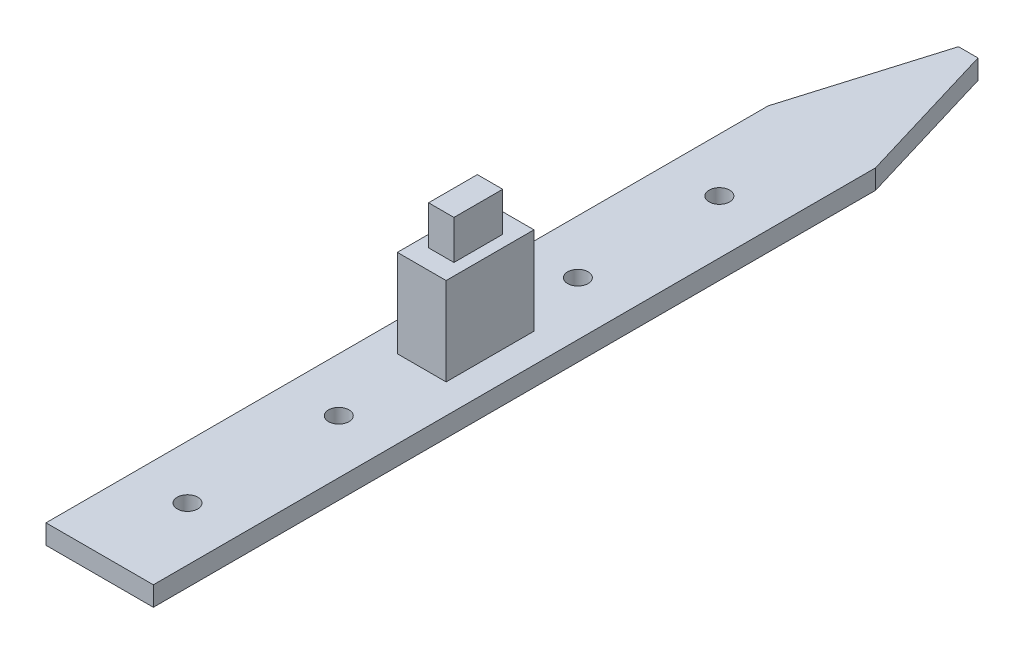
ISO-10303-21;
HEADER;
FILE_DESCRIPTION(('STEP AP214'),'2;1');
FILE_NAME('part.step','',(''),(''),'','','');
FILE_SCHEMA(('AUTOMOTIVE_DESIGN { 1 0 10303 214 1 1 1 1 }'));
ENDSEC;
DATA;
#1=APPLICATION_CONTEXT('core data for automotive mechanical design processes');
#2=APPLICATION_PROTOCOL_DEFINITION('international standard','automotive_design',2000,#1);
#3=PRODUCT_CONTEXT('',#1,'mechanical');
#4=PRODUCT('Part','Part','',(#3));
#5=PRODUCT_RELATED_PRODUCT_CATEGORY('part','',(#4));
#6=PRODUCT_DEFINITION_FORMATION('','',#4);
#7=PRODUCT_DEFINITION_CONTEXT('part definition',#1,'design');
#8=PRODUCT_DEFINITION('design','',#6,#7);
#9=PRODUCT_DEFINITION_SHAPE('','',#8);
#10=(LENGTH_UNIT() NAMED_UNIT(*) SI_UNIT(.MILLI.,.METRE.));
#11=(NAMED_UNIT(*) PLANE_ANGLE_UNIT() SI_UNIT($,.RADIAN.));
#12=(NAMED_UNIT(*) SI_UNIT($,.STERADIAN.) SOLID_ANGLE_UNIT());
#13=UNCERTAINTY_MEASURE_WITH_UNIT(LENGTH_MEASURE(1.E-05),#10,'distance_accuracy_value','');
#14=(GEOMETRIC_REPRESENTATION_CONTEXT(3) GLOBAL_UNCERTAINTY_ASSIGNED_CONTEXT((#13)) GLOBAL_UNIT_ASSIGNED_CONTEXT((#10,
#11,#12)) REPRESENTATION_CONTEXT('',''));
#15=CARTESIAN_POINT('',(0.,0.,0.));
#16=DIRECTION('',(0.,0.,1.));
#17=DIRECTION('',(1.,0.,0.));
#18=AXIS2_PLACEMENT_3D('',#15,#16,#17);
#19=CARTESIAN_POINT('',(0.,2.,0.));
#20=DIRECTION('',(0.,1.,0.));
#21=DIRECTION('',(0.,0.,1.));
#22=AXIS2_PLACEMENT_3D('',#19,#20,#21);
#23=PLANE('',#22);
#24=CARTESIAN_POINT('',(5.5,2.,-9.));
#25=DIRECTION('',(0.,1.,0.));
#26=DIRECTION('',(0.,0.,1.));
#27=AXIS2_PLACEMENT_3D('',#24,#25,#26);
#28=CIRCLE('',#27,1.05);
#29=CARTESIAN_POINT('',(5.5,2.,-7.95));
#30=VERTEX_POINT('',#29);
#31=EDGE_CURVE('E215',#30,#30,#28,.T.);
#32=ORIENTED_EDGE('',*,*,#31,.F.);
#33=EDGE_LOOP('',(#32));
#34=FACE_BOUND('',#33,.T.);
#35=CARTESIAN_POINT('',(5.5,2.,-24.5));
#36=DIRECTION('',(0.,1.,0.));
#37=DIRECTION('',(0.,0.,1.));
#38=AXIS2_PLACEMENT_3D('',#35,#36,#37);
#39=CIRCLE('',#38,1.05);
#40=CARTESIAN_POINT('',(5.5,2.,-23.45));
#41=VERTEX_POINT('',#40);
#42=EDGE_CURVE('E220',#41,#41,#39,.T.);
#43=ORIENTED_EDGE('',*,*,#42,.F.);
#44=EDGE_LOOP('',(#43));
#45=FACE_BOUND('',#44,.T.);
#46=CARTESIAN_POINT('',(5.5,2.,-49.));
#47=DIRECTION('',(0.,1.,0.));
#48=DIRECTION('',(0.,0.,1.));
#49=AXIS2_PLACEMENT_3D('',#46,#47,#48);
#50=CIRCLE('',#49,1.05);
#51=CARTESIAN_POINT('',(5.5,2.,-47.95));
#52=VERTEX_POINT('',#51);
#53=EDGE_CURVE('E229',#52,#52,#50,.T.);
#54=ORIENTED_EDGE('',*,*,#53,.F.);
#55=EDGE_LOOP('',(#54));
#56=FACE_BOUND('',#55,.T.);
#57=CARTESIAN_POINT('',(5.5,2.,-63.5));
#58=DIRECTION('',(0.,1.,0.));
#59=DIRECTION('',(0.,0.,1.));
#60=AXIS2_PLACEMENT_3D('',#57,#58,#59);
#61=CIRCLE('',#60,1.04999999999999);
#62=CARTESIAN_POINT('',(5.5,2.,-62.45));
#63=VERTEX_POINT('',#62);
#64=EDGE_CURVE('E237',#63,#63,#61,.T.);
#65=ORIENTED_EDGE('',*,*,#64,.F.);
#66=EDGE_LOOP('',(#65));
#67=FACE_BOUND('',#66,.T.);
#68=DIRECTION('',(0.,0.,1.));
#69=VECTOR('',#68,1.);
#70=CARTESIAN_POINT('',(0.,2.,-74.));
#71=LINE('',#70,#69);
#72=CARTESIAN_POINT('',(0.,2.,-74.));
#73=VERTEX_POINT('',#72);
#74=CARTESIAN_POINT('',(0.,2.,0.));
#75=VERTEX_POINT('',#74);
#76=EDGE_CURVE('E273',#73,#75,#71,.T.);
#77=ORIENTED_EDGE('',*,*,#76,.T.);
#78=DIRECTION('',(1.,0.,0.));
#79=VECTOR('',#78,1.);
#80=CARTESIAN_POINT('',(0.,2.,0.));
#81=LINE('',#80,#79);
#82=CARTESIAN_POINT('',(11.,2.,0.));
#83=VERTEX_POINT('',#82);
#84=EDGE_CURVE('E277',#75,#83,#81,.T.);
#85=ORIENTED_EDGE('',*,*,#84,.T.);
#86=DIRECTION('',(0.,0.,1.));
#87=VECTOR('',#86,1.);
#88=CARTESIAN_POINT('',(11.,2.,-74.));
#89=LINE('',#88,#87);
#90=CARTESIAN_POINT('',(11.,2.,-74.));
#91=VERTEX_POINT('',#90);
#92=EDGE_CURVE('E247',#91,#83,#89,.T.);
#93=ORIENTED_EDGE('',*,*,#92,.F.);
#94=DIRECTION('',(0.287347885566346,0.,0.957826285221151));
#95=VECTOR('',#94,1.);
#96=CARTESIAN_POINT('',(6.5,2.,-89.));
#97=LINE('',#96,#95);
#98=CARTESIAN_POINT('',(6.5,2.,-89.));
#99=VERTEX_POINT('',#98);
#100=EDGE_CURVE('E251',#99,#91,#97,.T.);
#101=ORIENTED_EDGE('',*,*,#100,.F.);
#102=DIRECTION('',(-1.,0.,0.));
#103=VECTOR('',#102,1.);
#104=CARTESIAN_POINT('',(5.5,2.,-89.));
#105=LINE('',#104,#103);
#106=CARTESIAN_POINT('',(4.5,2.,-89.));
#107=VERTEX_POINT('',#106);
#108=EDGE_CURVE('E281',#99,#107,#105,.T.);
#109=ORIENTED_EDGE('',*,*,#108,.T.);
#110=DIRECTION('',(-0.287347885566346,0.,0.957826285221151));
#111=VECTOR('',#110,1.);
#112=CARTESIAN_POINT('',(4.5,2.,-89.));
#113=LINE('',#112,#111);
#114=EDGE_CURVE('E284',#107,#73,#113,.T.);
#115=ORIENTED_EDGE('',*,*,#114,.T.);
#116=EDGE_LOOP('',(#77,#85,#93,#101,#109,#115));
#117=FACE_BOUND('',#116,.T.);
#118=DIRECTION('',(0.,0.,1.));
#119=VECTOR('',#118,1.);
#120=CARTESIAN_POINT('',(3.,2.,-42.));
#121=LINE('',#120,#119);
#122=CARTESIAN_POINT('',(3.,2.,-42.));
#123=VERTEX_POINT('',#122);
#124=CARTESIAN_POINT('',(3.,2.,-33.));
#125=VERTEX_POINT('',#124);
#126=EDGE_CURVE('E172',#123,#125,#121,.T.);
#127=ORIENTED_EDGE('',*,*,#126,.F.);
#128=DIRECTION('',(-1.,0.,0.));
#129=VECTOR('',#128,1.);
#130=CARTESIAN_POINT('',(8.,2.,-42.));
#131=LINE('',#130,#129);
#132=CARTESIAN_POINT('',(8.,2.,-42.));
#133=VERTEX_POINT('',#132);
#134=EDGE_CURVE('E167',#133,#123,#131,.T.);
#135=ORIENTED_EDGE('',*,*,#134,.F.);
#136=DIRECTION('',(0.,0.,-1.));
#137=VECTOR('',#136,1.);
#138=CARTESIAN_POINT('',(8.,2.,-33.));
#139=LINE('',#138,#137);
#140=CARTESIAN_POINT('',(8.,2.,-33.));
#141=VERTEX_POINT('',#140);
#142=EDGE_CURVE('E183',#141,#133,#139,.T.);
#143=ORIENTED_EDGE('',*,*,#142,.F.);
#144=DIRECTION('',(1.,0.,0.));
#145=VECTOR('',#144,1.);
#146=CARTESIAN_POINT('',(3.,2.,-33.));
#147=LINE('',#146,#145);
#148=EDGE_CURVE('E195',#125,#141,#147,.T.);
#149=ORIENTED_EDGE('',*,*,#148,.F.);
#150=EDGE_LOOP('',(#127,#135,#143,#149));
#151=FACE_BOUND('',#150,.T.);
#152=ADVANCED_FACE('F42',(#34,#45,#56,#67,#117,#151),#23,.T.);
#153=CARTESIAN_POINT('',(0.,2.,-74.));
#154=DIRECTION('',(1.,0.,0.));
#155=DIRECTION('',(0.,0.,-1.));
#156=AXIS2_PLACEMENT_3D('',#153,#154,#155);
#157=PLANE('',#156);
#158=DIRECTION('',(0.,0.,1.));
#159=VECTOR('',#158,1.);
#160=CARTESIAN_POINT('',(0.,0.,-74.));
#161=LINE('',#160,#159);
#162=CARTESIAN_POINT('',(0.,0.,-74.));
#163=VERTEX_POINT('',#162);
#164=CARTESIAN_POINT('',(0.,0.,0.));
#165=VERTEX_POINT('',#164);
#166=EDGE_CURVE('E272',#163,#165,#161,.T.);
#167=ORIENTED_EDGE('',*,*,#166,.T.);
#168=DIRECTION('',(0.,-1.,0.));
#169=VECTOR('',#168,1.);
#170=CARTESIAN_POINT('',(0.,2.,0.));
#171=LINE('',#170,#169);
#172=EDGE_CURVE('E11',#75,#165,#171,.T.);
#173=ORIENTED_EDGE('',*,*,#172,.F.);
#174=ORIENTED_EDGE('',*,*,#76,.F.);
#175=DIRECTION('',(0.,-1.,0.));
#176=VECTOR('',#175,1.);
#177=CARTESIAN_POINT('',(0.,2.,-74.));
#178=LINE('',#177,#176);
#179=EDGE_CURVE('E287',#73,#163,#178,.T.);
#180=ORIENTED_EDGE('',*,*,#179,.T.);
#181=EDGE_LOOP('',(#167,#173,#174,#180));
#182=FACE_BOUND('',#181,.T.);
#183=ADVANCED_FACE('F44',(#182),#157,.F.);
#184=CARTESIAN_POINT('',(0.,2.,0.));
#185=DIRECTION('',(0.,0.,-1.));
#186=DIRECTION('',(-1.,0.,0.));
#187=AXIS2_PLACEMENT_3D('',#184,#185,#186);
#188=PLANE('',#187);
#189=DIRECTION('',(1.,0.,0.));
#190=VECTOR('',#189,1.);
#191=CARTESIAN_POINT('',(0.,0.,0.));
#192=LINE('',#191,#190);
#193=CARTESIAN_POINT('',(11.,0.,0.));
#194=VERTEX_POINT('',#193);
#195=EDGE_CURVE('E291',#165,#194,#192,.T.);
#196=ORIENTED_EDGE('',*,*,#195,.T.);
#197=DIRECTION('',(0.,-1.,0.));
#198=VECTOR('',#197,1.);
#199=CARTESIAN_POINT('',(11.,2.,0.));
#200=LINE('',#199,#198);
#201=EDGE_CURVE('E268',#83,#194,#200,.T.);
#202=ORIENTED_EDGE('',*,*,#201,.F.);
#203=ORIENTED_EDGE('',*,*,#84,.F.);
#204=ORIENTED_EDGE('',*,*,#172,.T.);
#205=EDGE_LOOP('',(#196,#202,#203,#204));
#206=FACE_BOUND('',#205,.T.);
#207=ADVANCED_FACE('F331',(#206),#188,.F.);
#208=CARTESIAN_POINT('',(5.5,2.,-89.));
#209=DIRECTION('',(0.,0.,1.));
#210=DIRECTION('',(1.,0.,0.));
#211=AXIS2_PLACEMENT_3D('',#208,#209,#210);
#212=PLANE('',#211);
#213=DIRECTION('',(-1.,0.,0.));
#214=VECTOR('',#213,1.);
#215=CARTESIAN_POINT('',(5.5,0.,-89.));
#216=LINE('',#215,#214);
#217=CARTESIAN_POINT('',(6.5,0.,-89.));
#218=VERTEX_POINT('',#217);
#219=CARTESIAN_POINT('',(4.5,0.,-89.));
#220=VERTEX_POINT('',#219);
#221=EDGE_CURVE('E294',#218,#220,#216,.T.);
#222=ORIENTED_EDGE('',*,*,#221,.T.);
#223=DIRECTION('',(0.,-1.,0.));
#224=VECTOR('',#223,1.);
#225=CARTESIAN_POINT('',(4.5,2.,-89.));
#226=LINE('',#225,#224);
#227=EDGE_CURVE('E51',#107,#220,#226,.T.);
#228=ORIENTED_EDGE('',*,*,#227,.F.);
#229=ORIENTED_EDGE('',*,*,#108,.F.);
#230=DIRECTION('',(0.,-1.,0.));
#231=VECTOR('',#230,1.);
#232=CARTESIAN_POINT('',(6.5,2.,-89.));
#233=LINE('',#232,#231);
#234=EDGE_CURVE('E264',#99,#218,#233,.T.);
#235=ORIENTED_EDGE('',*,*,#234,.T.);
#236=EDGE_LOOP('',(#222,#228,#229,#235));
#237=FACE_BOUND('',#236,.T.);
#238=ADVANCED_FACE('F323',(#237),#212,.F.);
#239=CARTESIAN_POINT('',(4.5,2.,-89.));
#240=DIRECTION('',(0.957826285221151,0.,0.287347885566346));
#241=DIRECTION('',(0.287347885566346,0.,-0.957826285221151));
#242=AXIS2_PLACEMENT_3D('',#239,#240,#241);
#243=PLANE('',#242);
#244=DIRECTION('',(-0.287347885566346,0.,0.957826285221151));
#245=VECTOR('',#244,1.);
#246=CARTESIAN_POINT('',(4.5,0.,-89.));
#247=LINE('',#246,#245);
#248=EDGE_CURVE('E278',#220,#163,#247,.T.);
#249=ORIENTED_EDGE('',*,*,#248,.T.);
#250=ORIENTED_EDGE('',*,*,#179,.F.);
#251=ORIENTED_EDGE('',*,*,#114,.F.);
#252=ORIENTED_EDGE('',*,*,#227,.T.);
#253=EDGE_LOOP('',(#249,#250,#251,#252));
#254=FACE_BOUND('',#253,.T.);
#255=ADVANCED_FACE('F307',(#254),#243,.F.);
#256=CARTESIAN_POINT('',(0.,0.,0.));
#257=DIRECTION('',(0.,1.,0.));
#258=DIRECTION('',(0.,0.,1.));
#259=AXIS2_PLACEMENT_3D('',#256,#257,#258);
#260=PLANE('',#259);
#261=CARTESIAN_POINT('',(5.5,0.,-9.));
#262=DIRECTION('',(0.,1.,0.));
#263=DIRECTION('',(0.,0.,1.));
#264=AXIS2_PLACEMENT_3D('',#261,#262,#263);
#265=CIRCLE('',#264,1.05);
#266=CARTESIAN_POINT('',(5.5,0.,-7.95));
#267=VERTEX_POINT('',#266);
#268=EDGE_CURVE('E219',#267,#267,#265,.F.);
#269=ORIENTED_EDGE('',*,*,#268,.F.);
#270=EDGE_LOOP('',(#269));
#271=FACE_BOUND('',#270,.T.);
#272=CARTESIAN_POINT('',(5.5,0.,-24.5));
#273=DIRECTION('',(0.,1.,0.));
#274=DIRECTION('',(0.,0.,1.));
#275=AXIS2_PLACEMENT_3D('',#272,#273,#274);
#276=CIRCLE('',#275,1.05);
#277=CARTESIAN_POINT('',(5.5,0.,-23.45));
#278=VERTEX_POINT('',#277);
#279=EDGE_CURVE('E225',#278,#278,#276,.F.);
#280=ORIENTED_EDGE('',*,*,#279,.F.);
#281=EDGE_LOOP('',(#280));
#282=FACE_BOUND('',#281,.T.);
#283=CARTESIAN_POINT('',(5.5,0.,-49.));
#284=DIRECTION('',(0.,1.,0.));
#285=DIRECTION('',(0.,0.,1.));
#286=AXIS2_PLACEMENT_3D('',#283,#284,#285);
#287=CIRCLE('',#286,1.05);
#288=CARTESIAN_POINT('',(5.5,0.,-47.95));
#289=VERTEX_POINT('',#288);
#290=EDGE_CURVE('E233',#289,#289,#287,.F.);
#291=ORIENTED_EDGE('',*,*,#290,.F.);
#292=EDGE_LOOP('',(#291));
#293=FACE_BOUND('',#292,.T.);
#294=CARTESIAN_POINT('',(5.5,0.,-63.5));
#295=DIRECTION('',(0.,1.,0.));
#296=DIRECTION('',(0.,0.,1.));
#297=AXIS2_PLACEMENT_3D('',#294,#295,#296);
#298=CIRCLE('',#297,1.04999999999999);
#299=CARTESIAN_POINT('',(5.5,0.,-62.45));
#300=VERTEX_POINT('',#299);
#301=EDGE_CURVE('E214',#300,#300,#298,.F.);
#302=ORIENTED_EDGE('',*,*,#301,.F.);
#303=EDGE_LOOP('',(#302));
#304=FACE_BOUND('',#303,.T.);
#305=ORIENTED_EDGE('',*,*,#166,.F.);
#306=ORIENTED_EDGE('',*,*,#248,.F.);
#307=ORIENTED_EDGE('',*,*,#221,.F.);
#308=DIRECTION('',(0.287347885566346,0.,0.957826285221151));
#309=VECTOR('',#308,1.);
#310=CARTESIAN_POINT('',(6.5,0.,-89.));
#311=LINE('',#310,#309);
#312=CARTESIAN_POINT('',(11.,0.,-74.));
#313=VERTEX_POINT('',#312);
#314=EDGE_CURVE('E252',#218,#313,#311,.T.);
#315=ORIENTED_EDGE('',*,*,#314,.T.);
#316=DIRECTION('',(0.,0.,1.));
#317=VECTOR('',#316,1.);
#318=CARTESIAN_POINT('',(11.,0.,-74.));
#319=LINE('',#318,#317);
#320=EDGE_CURVE('E224',#313,#194,#319,.T.);
#321=ORIENTED_EDGE('',*,*,#320,.T.);
#322=ORIENTED_EDGE('',*,*,#195,.F.);
#323=EDGE_LOOP('',(#305,#306,#307,#315,#321,#322));
#324=FACE_BOUND('',#323,.T.);
#325=ADVANCED_FACE('F312',(#271,#282,#293,#304,#324),#260,.F.);
#326=CARTESIAN_POINT('',(11.,2.,-74.));
#327=DIRECTION('',(-1.,0.,0.));
#328=DIRECTION('',(0.,0.,-1.));
#329=AXIS2_PLACEMENT_3D('',#326,#327,#328);
#330=PLANE('',#329);
#331=ORIENTED_EDGE('',*,*,#320,.F.);
#332=DIRECTION('',(0.,-1.,0.));
#333=VECTOR('',#332,1.);
#334=CARTESIAN_POINT('',(11.,2.,-74.));
#335=LINE('',#334,#333);
#336=EDGE_CURVE('E255',#91,#313,#335,.T.);
#337=ORIENTED_EDGE('',*,*,#336,.F.);
#338=ORIENTED_EDGE('',*,*,#92,.T.);
#339=ORIENTED_EDGE('',*,*,#201,.T.);
#340=EDGE_LOOP('',(#331,#337,#338,#339));
#341=FACE_BOUND('',#340,.T.);
#342=ADVANCED_FACE('F329',(#341),#330,.F.);
#343=CARTESIAN_POINT('',(6.5,2.,-89.));
#344=DIRECTION('',(-0.957826285221151,0.,0.287347885566346));
#345=DIRECTION('',(-0.287347885566346,0.,-0.957826285221151));
#346=AXIS2_PLACEMENT_3D('',#343,#344,#345);
#347=PLANE('',#346);
#348=ORIENTED_EDGE('',*,*,#314,.F.);
#349=ORIENTED_EDGE('',*,*,#234,.F.);
#350=ORIENTED_EDGE('',*,*,#100,.T.);
#351=ORIENTED_EDGE('',*,*,#336,.T.);
#352=EDGE_LOOP('',(#348,#349,#350,#351));
#353=FACE_BOUND('',#352,.T.);
#354=ADVANCED_FACE('F325',(#353),#347,.F.);
#355=CARTESIAN_POINT('',(5.5,-2.96984848098351,-63.5));
#356=DIRECTION('',(0.,1.,0.));
#357=DIRECTION('',(0.,0.,1.));
#358=AXIS2_PLACEMENT_3D('',#355,#356,#357);
#359=CYLINDRICAL_SURFACE('',#358,1.04999999999999);
#360=ORIENTED_EDGE('',*,*,#301,.T.);
#361=EDGE_LOOP('',(#360));
#362=FACE_BOUND('',#361,.T.);
#363=ORIENTED_EDGE('',*,*,#64,.T.);
#364=EDGE_LOOP('',(#363));
#365=FACE_BOUND('',#364,.T.);
#366=ADVANCED_FACE('F373',(#362,#365),#359,.F.);
#367=CARTESIAN_POINT('',(5.5,-2.96984848098351,-49.));
#368=DIRECTION('',(0.,1.,0.));
#369=DIRECTION('',(0.,0.,1.));
#370=AXIS2_PLACEMENT_3D('',#367,#368,#369);
#371=CYLINDRICAL_SURFACE('',#370,1.05);
#372=ORIENTED_EDGE('',*,*,#290,.T.);
#373=EDGE_LOOP('',(#372));
#374=FACE_BOUND('',#373,.T.);
#375=ORIENTED_EDGE('',*,*,#53,.T.);
#376=EDGE_LOOP('',(#375));
#377=FACE_BOUND('',#376,.T.);
#378=ADVANCED_FACE('F378',(#374,#377),#371,.F.);
#379=CARTESIAN_POINT('',(5.5,-2.96984848098351,-24.5));
#380=DIRECTION('',(0.,1.,0.));
#381=DIRECTION('',(0.,0.,1.));
#382=AXIS2_PLACEMENT_3D('',#379,#380,#381);
#383=CYLINDRICAL_SURFACE('',#382,1.05);
#384=ORIENTED_EDGE('',*,*,#279,.T.);
#385=EDGE_LOOP('',(#384));
#386=FACE_BOUND('',#385,.T.);
#387=ORIENTED_EDGE('',*,*,#42,.T.);
#388=EDGE_LOOP('',(#387));
#389=FACE_BOUND('',#388,.T.);
#390=ADVANCED_FACE('F386',(#386,#389),#383,.F.);
#391=CARTESIAN_POINT('',(5.5,-2.96984848098351,-9.));
#392=DIRECTION('',(0.,1.,0.));
#393=DIRECTION('',(0.,0.,1.));
#394=AXIS2_PLACEMENT_3D('',#391,#392,#393);
#395=CYLINDRICAL_SURFACE('',#394,1.05);
#396=ORIENTED_EDGE('',*,*,#268,.T.);
#397=EDGE_LOOP('',(#396));
#398=FACE_BOUND('',#397,.T.);
#399=ORIENTED_EDGE('',*,*,#31,.T.);
#400=EDGE_LOOP('',(#399));
#401=FACE_BOUND('',#400,.T.);
#402=ADVANCED_FACE('F394',(#398,#401),#395,.F.);
#403=CARTESIAN_POINT('',(8.,11.,-42.));
#404=DIRECTION('',(0.,0.,1.));
#405=DIRECTION('',(1.,0.,0.));
#406=AXIS2_PLACEMENT_3D('',#403,#404,#405);
#407=PLANE('',#406);
#408=ORIENTED_EDGE('',*,*,#134,.T.);
#409=DIRECTION('',(0.,-1.,0.));
#410=VECTOR('',#409,1.);
#411=CARTESIAN_POINT('',(3.,11.,-42.));
#412=LINE('',#411,#410);
#413=CARTESIAN_POINT('',(3.,11.,-42.));
#414=VERTEX_POINT('',#413);
#415=EDGE_CURVE('E211',#414,#123,#412,.T.);
#416=ORIENTED_EDGE('',*,*,#415,.F.);
#417=DIRECTION('',(-1.,0.,0.));
#418=VECTOR('',#417,1.);
#419=CARTESIAN_POINT('',(8.,11.,-42.));
#420=LINE('',#419,#418);
#421=CARTESIAN_POINT('',(8.,11.,-42.));
#422=VERTEX_POINT('',#421);
#423=EDGE_CURVE('E178',#422,#414,#420,.T.);
#424=ORIENTED_EDGE('',*,*,#423,.F.);
#425=DIRECTION('',(0.,-1.,0.));
#426=VECTOR('',#425,1.);
#427=CARTESIAN_POINT('',(8.,11.,-42.));
#428=LINE('',#427,#426);
#429=EDGE_CURVE('E191',#422,#133,#428,.T.);
#430=ORIENTED_EDGE('',*,*,#429,.T.);
#431=EDGE_LOOP('',(#408,#416,#424,#430));
#432=FACE_BOUND('',#431,.T.);
#433=ADVANCED_FACE('F402',(#432),#407,.F.);
#434=CARTESIAN_POINT('',(3.,11.,-42.));
#435=DIRECTION('',(1.,0.,0.));
#436=DIRECTION('',(0.,0.,-1.));
#437=AXIS2_PLACEMENT_3D('',#434,#435,#436);
#438=PLANE('',#437);
#439=ORIENTED_EDGE('',*,*,#126,.T.);
#440=DIRECTION('',(0.,-1.,0.));
#441=VECTOR('',#440,1.);
#442=CARTESIAN_POINT('',(3.,11.,-33.));
#443=LINE('',#442,#441);
#444=CARTESIAN_POINT('',(3.,11.,-33.));
#445=VERTEX_POINT('',#444);
#446=EDGE_CURVE('E207',#445,#125,#443,.T.);
#447=ORIENTED_EDGE('',*,*,#446,.F.);
#448=DIRECTION('',(0.,0.,1.));
#449=VECTOR('',#448,1.);
#450=CARTESIAN_POINT('',(3.,11.,-42.));
#451=LINE('',#450,#449);
#452=EDGE_CURVE('E182',#414,#445,#451,.T.);
#453=ORIENTED_EDGE('',*,*,#452,.F.);
#454=ORIENTED_EDGE('',*,*,#415,.T.);
#455=EDGE_LOOP('',(#439,#447,#453,#454));
#456=FACE_BOUND('',#455,.T.);
#457=ADVANCED_FACE('F410',(#456),#438,.F.);
#458=CARTESIAN_POINT('',(3.,11.,-33.));
#459=DIRECTION('',(0.,0.,-1.));
#460=DIRECTION('',(-1.,0.,0.));
#461=AXIS2_PLACEMENT_3D('',#458,#459,#460);
#462=PLANE('',#461);
#463=ORIENTED_EDGE('',*,*,#148,.T.);
#464=DIRECTION('',(0.,-1.,0.));
#465=VECTOR('',#464,1.);
#466=CARTESIAN_POINT('',(8.,11.,-33.));
#467=LINE('',#466,#465);
#468=CARTESIAN_POINT('',(8.,11.,-33.));
#469=VERTEX_POINT('',#468);
#470=EDGE_CURVE('E204',#469,#141,#467,.T.);
#471=ORIENTED_EDGE('',*,*,#470,.F.);
#472=DIRECTION('',(1.,0.,0.));
#473=VECTOR('',#472,1.);
#474=CARTESIAN_POINT('',(3.,11.,-33.));
#475=LINE('',#474,#473);
#476=EDGE_CURVE('E186',#445,#469,#475,.T.);
#477=ORIENTED_EDGE('',*,*,#476,.F.);
#478=ORIENTED_EDGE('',*,*,#446,.T.);
#479=EDGE_LOOP('',(#463,#471,#477,#478));
#480=FACE_BOUND('',#479,.T.);
#481=ADVANCED_FACE('F418',(#480),#462,.F.);
#482=CARTESIAN_POINT('',(8.,11.,-33.));
#483=DIRECTION('',(-1.,0.,0.));
#484=DIRECTION('',(0.,0.,1.));
#485=AXIS2_PLACEMENT_3D('',#482,#483,#484);
#486=PLANE('',#485);
#487=ORIENTED_EDGE('',*,*,#142,.T.);
#488=ORIENTED_EDGE('',*,*,#429,.F.);
#489=DIRECTION('',(0.,0.,-1.));
#490=VECTOR('',#489,1.);
#491=CARTESIAN_POINT('',(8.,11.,-33.));
#492=LINE('',#491,#490);
#493=EDGE_CURVE('E189',#469,#422,#492,.T.);
#494=ORIENTED_EDGE('',*,*,#493,.F.);
#495=ORIENTED_EDGE('',*,*,#470,.T.);
#496=EDGE_LOOP('',(#487,#488,#494,#495));
#497=FACE_BOUND('',#496,.T.);
#498=ADVANCED_FACE('F426',(#497),#486,.F.);
#499=CARTESIAN_POINT('',(0.,11.,0.));
#500=DIRECTION('',(0.,1.,0.));
#501=DIRECTION('',(0.,0.,1.));
#502=AXIS2_PLACEMENT_3D('',#499,#500,#501);
#503=PLANE('',#502);
#504=DIRECTION('',(0.,0.,1.));
#505=VECTOR('',#504,1.);
#506=CARTESIAN_POINT('',(4.2,11.,-40.));
#507=LINE('',#506,#505);
#508=CARTESIAN_POINT('',(4.2,11.,-40.));
#509=VERTEX_POINT('',#508);
#510=CARTESIAN_POINT('',(4.2,11.,-35.));
#511=VERTEX_POINT('',#510);
#512=EDGE_CURVE('E58',#509,#511,#507,.T.);
#513=ORIENTED_EDGE('',*,*,#512,.F.);
#514=DIRECTION('',(-1.,0.,0.));
#515=VECTOR('',#514,1.);
#516=CARTESIAN_POINT('',(4.2,11.,-40.));
#517=LINE('',#516,#515);
#518=CARTESIAN_POINT('',(6.8,11.,-40.));
#519=VERTEX_POINT('',#518);
#520=EDGE_CURVE('E62',#519,#509,#517,.T.);
#521=ORIENTED_EDGE('',*,*,#520,.F.);
#522=DIRECTION('',(0.,0.,-1.));
#523=VECTOR('',#522,1.);
#524=CARTESIAN_POINT('',(6.8,11.,-40.));
#525=LINE('',#524,#523);
#526=CARTESIAN_POINT('',(6.8,11.,-35.));
#527=VERTEX_POINT('',#526);
#528=EDGE_CURVE('E591',#527,#519,#525,.T.);
#529=ORIENTED_EDGE('',*,*,#528,.F.);
#530=DIRECTION('',(1.,0.,0.));
#531=VECTOR('',#530,1.);
#532=CARTESIAN_POINT('',(4.2,11.,-35.));
#533=LINE('',#532,#531);
#534=EDGE_CURVE('E601',#511,#527,#533,.T.);
#535=ORIENTED_EDGE('',*,*,#534,.F.);
#536=EDGE_LOOP('',(#513,#521,#529,#535));
#537=FACE_BOUND('',#536,.T.);
#538=ORIENTED_EDGE('',*,*,#423,.T.);
#539=ORIENTED_EDGE('',*,*,#452,.T.);
#540=ORIENTED_EDGE('',*,*,#476,.T.);
#541=ORIENTED_EDGE('',*,*,#493,.T.);
#542=EDGE_LOOP('',(#538,#539,#540,#541));
#543=FACE_BOUND('',#542,.T.);
#544=ADVANCED_FACE('F434',(#537,#543),#503,.T.);
#545=CARTESIAN_POINT('',(4.2,15.,-40.));
#546=DIRECTION('',(1.,0.,0.));
#547=DIRECTION('',(0.,0.,-1.));
#548=AXIS2_PLACEMENT_3D('',#545,#546,#547);
#549=PLANE('',#548);
#550=ORIENTED_EDGE('',*,*,#512,.T.);
#551=DIRECTION('',(0.,-1.,0.));
#552=VECTOR('',#551,1.);
#553=CARTESIAN_POINT('',(4.2,15.,-35.));
#554=LINE('',#553,#552);
#555=CARTESIAN_POINT('',(4.2,15.,-35.));
#556=VERTEX_POINT('',#555);
#557=EDGE_CURVE('E147',#556,#511,#554,.T.);
#558=ORIENTED_EDGE('',*,*,#557,.F.);
#559=DIRECTION('',(0.,0.,1.));
#560=VECTOR('',#559,1.);
#561=CARTESIAN_POINT('',(4.2,15.,-40.));
#562=LINE('',#561,#560);
#563=CARTESIAN_POINT('',(4.2,15.,-40.));
#564=VERTEX_POINT('',#563);
#565=EDGE_CURVE('E154',#564,#556,#562,.T.);
#566=ORIENTED_EDGE('',*,*,#565,.F.);
#567=DIRECTION('',(0.,-1.,0.));
#568=VECTOR('',#567,1.);
#569=CARTESIAN_POINT('',(4.2,15.,-40.));
#570=LINE('',#569,#568);
#571=EDGE_CURVE('E588',#564,#509,#570,.T.);
#572=ORIENTED_EDGE('',*,*,#571,.T.);
#573=EDGE_LOOP('',(#550,#558,#566,#572));
#574=FACE_BOUND('',#573,.T.);
#575=ADVANCED_FACE('F165',(#574),#549,.F.);
#576=CARTESIAN_POINT('',(4.2,15.,-35.));
#577=DIRECTION('',(0.,0.,-1.));
#578=DIRECTION('',(-1.,0.,0.));
#579=AXIS2_PLACEMENT_3D('',#576,#577,#578);
#580=PLANE('',#579);
#581=ORIENTED_EDGE('',*,*,#534,.T.);
#582=DIRECTION('',(0.,-1.,0.));
#583=VECTOR('',#582,1.);
#584=CARTESIAN_POINT('',(6.8,15.,-35.));
#585=LINE('',#584,#583);
#586=CARTESIAN_POINT('',(6.8,15.,-35.));
#587=VERTEX_POINT('',#586);
#588=EDGE_CURVE('E149',#587,#527,#585,.T.);
#589=ORIENTED_EDGE('',*,*,#588,.F.);
#590=DIRECTION('',(1.,0.,0.));
#591=VECTOR('',#590,1.);
#592=CARTESIAN_POINT('',(4.2,15.,-35.));
#593=LINE('',#592,#591);
#594=EDGE_CURVE('E142',#556,#587,#593,.T.);
#595=ORIENTED_EDGE('',*,*,#594,.F.);
#596=ORIENTED_EDGE('',*,*,#557,.T.);
#597=EDGE_LOOP('',(#581,#589,#595,#596));
#598=FACE_BOUND('',#597,.T.);
#599=ADVANCED_FACE('F145',(#598),#580,.F.);
#600=CARTESIAN_POINT('',(6.8,15.,-40.));
#601=DIRECTION('',(-1.,0.,0.));
#602=DIRECTION('',(0.,0.,1.));
#603=AXIS2_PLACEMENT_3D('',#600,#601,#602);
#604=PLANE('',#603);
#605=ORIENTED_EDGE('',*,*,#528,.T.);
#606=DIRECTION('',(0.,-1.,0.));
#607=VECTOR('',#606,1.);
#608=CARTESIAN_POINT('',(6.8,15.,-40.));
#609=LINE('',#608,#607);
#610=CARTESIAN_POINT('',(6.8,15.,-40.));
#611=VERTEX_POINT('',#610);
#612=EDGE_CURVE('E174',#611,#519,#609,.T.);
#613=ORIENTED_EDGE('',*,*,#612,.F.);
#614=DIRECTION('',(0.,0.,-1.));
#615=VECTOR('',#614,1.);
#616=CARTESIAN_POINT('',(6.8,15.,-40.));
#617=LINE('',#616,#615);
#618=EDGE_CURVE('E153',#587,#611,#617,.T.);
#619=ORIENTED_EDGE('',*,*,#618,.F.);
#620=ORIENTED_EDGE('',*,*,#588,.T.);
#621=EDGE_LOOP('',(#605,#613,#619,#620));
#622=FACE_BOUND('',#621,.T.);
#623=ADVANCED_FACE('F454',(#622),#604,.F.);
#624=CARTESIAN_POINT('',(4.2,15.,-40.));
#625=DIRECTION('',(0.,0.,1.));
#626=DIRECTION('',(1.,0.,0.));
#627=AXIS2_PLACEMENT_3D('',#624,#625,#626);
#628=PLANE('',#627);
#629=ORIENTED_EDGE('',*,*,#520,.T.);
#630=ORIENTED_EDGE('',*,*,#571,.F.);
#631=DIRECTION('',(-1.,0.,0.));
#632=VECTOR('',#631,1.);
#633=CARTESIAN_POINT('',(4.2,15.,-40.));
#634=LINE('',#633,#632);
#635=EDGE_CURVE('E159',#611,#564,#634,.T.);
#636=ORIENTED_EDGE('',*,*,#635,.F.);
#637=ORIENTED_EDGE('',*,*,#612,.T.);
#638=EDGE_LOOP('',(#629,#630,#636,#637));
#639=FACE_BOUND('',#638,.T.);
#640=ADVANCED_FACE('F461',(#639),#628,.F.);
#641=CARTESIAN_POINT('',(0.,15.,0.));
#642=DIRECTION('',(0.,1.,0.));
#643=DIRECTION('',(0.,0.,1.));
#644=AXIS2_PLACEMENT_3D('',#641,#642,#643);
#645=PLANE('',#644);
#646=ORIENTED_EDGE('',*,*,#565,.T.);
#647=ORIENTED_EDGE('',*,*,#594,.T.);
#648=ORIENTED_EDGE('',*,*,#618,.T.);
#649=ORIENTED_EDGE('',*,*,#635,.T.);
#650=EDGE_LOOP('',(#646,#647,#648,#649));
#651=FACE_BOUND('',#650,.T.);
#652=ADVANCED_FACE('F157',(#651),#645,.T.);
#653=CLOSED_SHELL('',(#152,#183,#207,#238,#255,#325,#342,#354,#366,#378,#390,#402,#433,#457,
#481,#498,#544,#575,#599,#623,#640,#652));
#654=MANIFOLD_SOLID_BREP('B2',#653);
#655=ADVANCED_BREP_SHAPE_REPRESENTATION('',(#18,#654),#14);
#656=SHAPE_DEFINITION_REPRESENTATION(#9,#655);
ENDSEC;
END-ISO-10303-21;
